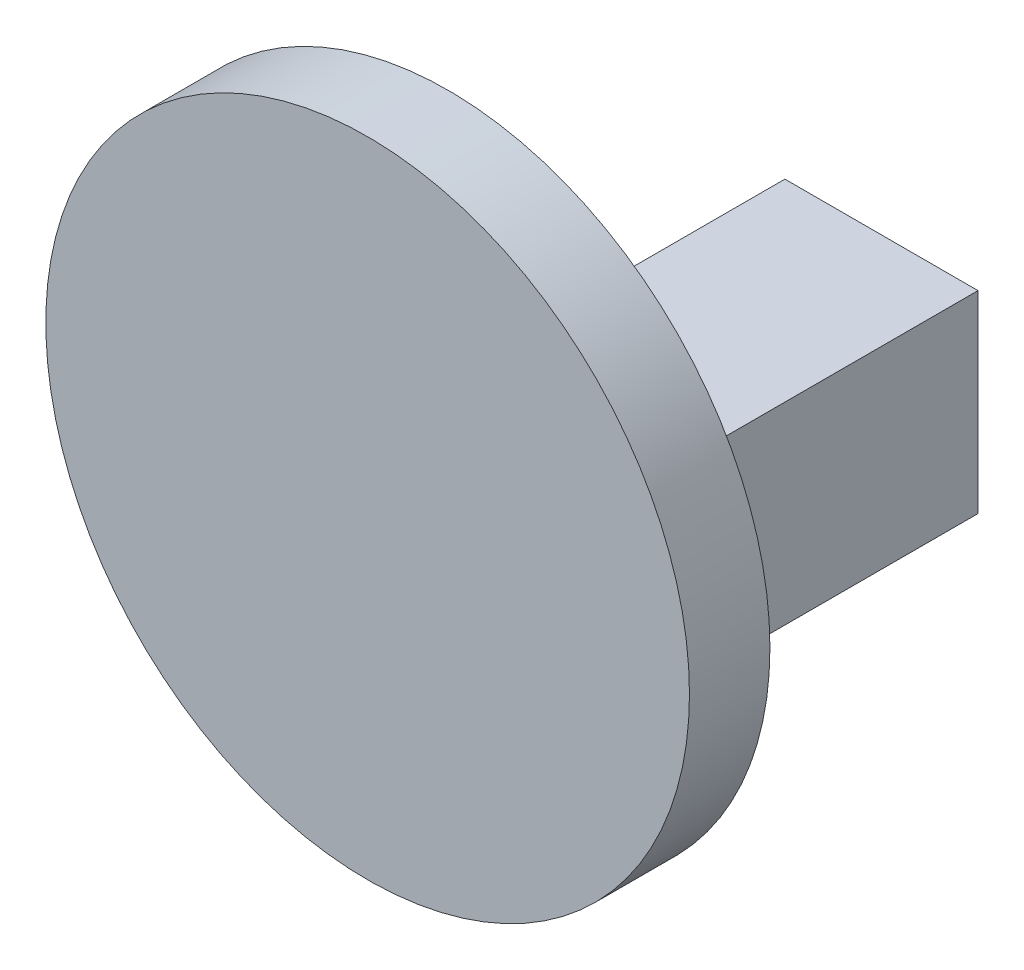
ISO-10303-21;
HEADER;
FILE_DESCRIPTION(('STEP AP214'),'2;1');
FILE_NAME('part.step','',(''),(''),'','','');
FILE_SCHEMA(('AUTOMOTIVE_DESIGN { 1 0 10303 214 1 1 1 1 }'));
ENDSEC;
DATA;
#1=APPLICATION_CONTEXT('core data for automotive mechanical design processes');
#2=APPLICATION_PROTOCOL_DEFINITION('international standard','automotive_design',2000,#1);
#3=PRODUCT_CONTEXT('',#1,'mechanical');
#4=PRODUCT('Part','Part','',(#3));
#5=PRODUCT_RELATED_PRODUCT_CATEGORY('part','',(#4));
#6=PRODUCT_DEFINITION_FORMATION('','',#4);
#7=PRODUCT_DEFINITION_CONTEXT('part definition',#1,'design');
#8=PRODUCT_DEFINITION('design','',#6,#7);
#9=PRODUCT_DEFINITION_SHAPE('','',#8);
#10=(LENGTH_UNIT() NAMED_UNIT(*) SI_UNIT(.MILLI.,.METRE.));
#11=(NAMED_UNIT(*) PLANE_ANGLE_UNIT() SI_UNIT($,.RADIAN.));
#12=(NAMED_UNIT(*) SI_UNIT($,.STERADIAN.) SOLID_ANGLE_UNIT());
#13=UNCERTAINTY_MEASURE_WITH_UNIT(LENGTH_MEASURE(1.E-05),#10,'distance_accuracy_value','');
#14=(GEOMETRIC_REPRESENTATION_CONTEXT(3) GLOBAL_UNCERTAINTY_ASSIGNED_CONTEXT((#13)) GLOBAL_UNIT_ASSIGNED_CONTEXT((#10,
#11,#12)) REPRESENTATION_CONTEXT('',''));
#15=CARTESIAN_POINT('',(0.,0.,0.));
#16=DIRECTION('',(0.,0.,1.));
#17=DIRECTION('',(1.,0.,0.));
#18=AXIS2_PLACEMENT_3D('',#15,#16,#17);
#19=CARTESIAN_POINT('',(73.8981732668994,12.5500000000009,275.981331654442));
#20=DIRECTION('',(0.,1.,0.));
#21=DIRECTION('',(-1.,0.,0.));
#22=AXIS2_PLACEMENT_3D('',#19,#20,#21);
#23=PLANE('',#22);
#24=DIRECTION('',(0.,0.,-1.));
#25=VECTOR('',#24,1.);
#26=CARTESIAN_POINT('',(61.8981732668994,12.5500000000009,252.302759373456));
#27=LINE('',#26,#25);
#28=CARTESIAN_POINT('',(61.8981732668994,12.5500000000009,275.481331654442));
#29=VERTEX_POINT('',#28);
#30=CARTESIAN_POINT('',(61.8981732668994,12.5500000000009,252.302759373456));
#31=VERTEX_POINT('',#30);
#32=EDGE_CURVE('E88',#29,#31,#27,.T.);
#33=ORIENTED_EDGE('',*,*,#32,.F.);
#34=DIRECTION('',(-1.,0.,0.));
#35=VECTOR('',#34,1.);
#36=CARTESIAN_POINT('',(73.8981732668994,12.5500000000009,275.481331654442));
#37=LINE('',#36,#35);
#38=CARTESIAN_POINT('',(73.8981732668994,12.5500000000009,275.481331654442));
#39=VERTEX_POINT('',#38);
#40=EDGE_CURVE('E11',#29,#39,#37,.F.);
#41=ORIENTED_EDGE('',*,*,#40,.T.);
#42=DIRECTION('',(0.,0.,-1.));
#43=VECTOR('',#42,1.);
#44=CARTESIAN_POINT('',(73.8981732668994,12.5500000000009,252.302759373456));
#45=LINE('',#44,#43);
#46=CARTESIAN_POINT('',(73.8981732668994,12.5500000000009,252.302759373456));
#47=VERTEX_POINT('',#46);
#48=EDGE_CURVE('E100',#39,#47,#45,.T.);
#49=ORIENTED_EDGE('',*,*,#48,.T.);
#50=DIRECTION('',(-1.,0.,0.));
#51=VECTOR('',#50,1.);
#52=CARTESIAN_POINT('',(73.8981732668994,12.5500000000009,252.302759373456));
#53=LINE('',#52,#51);
#54=EDGE_CURVE('E98',#47,#31,#53,.T.);
#55=ORIENTED_EDGE('',*,*,#54,.T.);
#56=EDGE_LOOP('',(#33,#41,#49,#55));
#57=FACE_BOUND('',#56,.T.);
#58=ADVANCED_FACE('F35',(#57),#23,.T.);
#59=CARTESIAN_POINT('',(73.8981732668994,0.55000000000085,254.516262844905));
#60=DIRECTION('',(0.,-1.,0.));
#61=DIRECTION('',(1.,0.,0.));
#62=AXIS2_PLACEMENT_3D('',#59,#60,#61);
#63=PLANE('',#62);
#64=DIRECTION('',(0.,0.,1.));
#65=VECTOR('',#64,1.);
#66=CARTESIAN_POINT('',(73.8981732668994,0.55000000000085,254.516262844905));
#67=LINE('',#66,#65);
#68=CARTESIAN_POINT('',(73.8981732668994,0.55000000000085,252.302759373456));
#69=VERTEX_POINT('',#68);
#70=CARTESIAN_POINT('',(73.8981732668994,0.55000000000085,275.481331654442));
#71=VERTEX_POINT('',#70);
#72=EDGE_CURVE('E105',#69,#71,#67,.T.);
#73=ORIENTED_EDGE('',*,*,#72,.T.);
#74=DIRECTION('',(-1.,0.,0.));
#75=VECTOR('',#74,1.);
#76=CARTESIAN_POINT('',(73.8981732668994,0.55000000000085,275.481331654442));
#77=LINE('',#76,#75);
#78=CARTESIAN_POINT('',(61.8981732668994,0.550000000000851,275.481331654442));
#79=VERTEX_POINT('',#78);
#80=EDGE_CURVE('E59',#71,#79,#77,.T.);
#81=ORIENTED_EDGE('',*,*,#80,.T.);
#82=DIRECTION('',(0.,0.,1.));
#83=VECTOR('',#82,1.);
#84=CARTESIAN_POINT('',(61.8981732668994,0.550000000000851,254.516262844905));
#85=LINE('',#84,#83);
#86=CARTESIAN_POINT('',(61.8981732668994,0.550000000000851,252.302759373456));
#87=VERTEX_POINT('',#86);
#88=EDGE_CURVE('E108',#87,#79,#85,.T.);
#89=ORIENTED_EDGE('',*,*,#88,.F.);
#90=DIRECTION('',(-1.,0.,0.));
#91=VECTOR('',#90,1.);
#92=CARTESIAN_POINT('',(73.8981732668994,0.55000000000085,252.302759373456));
#93=LINE('',#92,#91);
#94=EDGE_CURVE('E104',#69,#87,#93,.T.);
#95=ORIENTED_EDGE('',*,*,#94,.F.);
#96=EDGE_LOOP('',(#73,#81,#89,#95));
#97=FACE_BOUND('',#96,.T.);
#98=ADVANCED_FACE('F169',(#97),#63,.T.);
#99=CARTESIAN_POINT('',(73.8981732668994,0.55000000000085,252.302759373456));
#100=DIRECTION('',(0.,0.,-1.));
#101=DIRECTION('',(-1.,0.,0.));
#102=AXIS2_PLACEMENT_3D('',#99,#100,#101);
#103=PLANE('',#102);
#104=CARTESIAN_POINT('',(67.969208633093,7.01344682078051,252.302759373456));
#105=DIRECTION('',(0.,0.,-1.));
#106=DIRECTION('',(-1.,0.,0.));
#107=AXIS2_PLACEMENT_3D('',#104,#105,#106);
#108=CIRCLE('',#107,3.75000000000001);
#109=CARTESIAN_POINT('',(64.219208633093,7.01344682078051,252.302759373456));
#110=VERTEX_POINT('',#109);
#111=EDGE_CURVE('E152',#110,#110,#108,.T.);
#112=ORIENTED_EDGE('',*,*,#111,.F.);
#113=EDGE_LOOP('',(#112));
#114=FACE_BOUND('',#113,.T.);
#115=ORIENTED_EDGE('',*,*,#94,.T.);
#116=DIRECTION('',(0.,-1.,0.));
#117=VECTOR('',#116,1.);
#118=CARTESIAN_POINT('',(61.8981732668994,0.550000000000851,252.302759373456));
#119=LINE('',#118,#117);
#120=EDGE_CURVE('E92',#31,#87,#119,.T.);
#121=ORIENTED_EDGE('',*,*,#120,.F.);
#122=ORIENTED_EDGE('',*,*,#54,.F.);
#123=DIRECTION('',(0.,-1.,0.));
#124=VECTOR('',#123,1.);
#125=CARTESIAN_POINT('',(73.8981732668994,0.55000000000085,252.302759373456));
#126=LINE('',#125,#124);
#127=EDGE_CURVE('E114',#47,#69,#126,.T.);
#128=ORIENTED_EDGE('',*,*,#127,.T.);
#129=EDGE_LOOP('',(#115,#121,#122,#128));
#130=FACE_BOUND('',#129,.T.);
#131=ADVANCED_FACE('F107',(#114,#130),#103,.T.);
#132=CARTESIAN_POINT('',(73.8981732668994,0.,0.));
#133=DIRECTION('',(1.,0.,0.));
#134=DIRECTION('',(0.,0.,-1.));
#135=AXIS2_PLACEMENT_3D('',#132,#133,#134);
#136=PLANE('',#135);
#137=ORIENTED_EDGE('',*,*,#48,.F.);
#138=DIRECTION('',(0.,1.,0.));
#139=VECTOR('',#138,1.);
#140=CARTESIAN_POINT('',(73.8981732668994,0.,275.481331654442));
#141=LINE('',#140,#139);
#142=EDGE_CURVE('E127',#39,#71,#141,.F.);
#143=ORIENTED_EDGE('',*,*,#142,.T.);
#144=ORIENTED_EDGE('',*,*,#72,.F.);
#145=ORIENTED_EDGE('',*,*,#127,.F.);
#146=EDGE_LOOP('',(#137,#143,#144,#145));
#147=FACE_BOUND('',#146,.T.);
#148=ADVANCED_FACE('F168',(#147),#136,.T.);
#149=CARTESIAN_POINT('',(61.8981732668994,0.,0.));
#150=DIRECTION('',(1.,0.,0.));
#151=DIRECTION('',(0.,0.,-1.));
#152=AXIS2_PLACEMENT_3D('',#149,#150,#151);
#153=PLANE('',#152);
#154=ORIENTED_EDGE('',*,*,#88,.T.);
#155=DIRECTION('',(0.,1.,0.));
#156=VECTOR('',#155,1.);
#157=CARTESIAN_POINT('',(61.8981732668994,12.5500000000009,275.481331654442));
#158=LINE('',#157,#156);
#159=EDGE_CURVE('E44',#79,#29,#158,.T.);
#160=ORIENTED_EDGE('',*,*,#159,.T.);
#161=ORIENTED_EDGE('',*,*,#32,.T.);
#162=ORIENTED_EDGE('',*,*,#120,.T.);
#163=EDGE_LOOP('',(#154,#160,#161,#162));
#164=FACE_BOUND('',#163,.T.);
#165=ADVANCED_FACE('F90',(#164),#153,.F.);
#166=CARTESIAN_POINT('',(64.6470960692796,10.5500000000009,275.981331654442));
#167=DIRECTION('',(0.,0.,1.));
#168=DIRECTION('',(1.,0.,0.));
#169=AXIS2_PLACEMENT_3D('',#166,#167,#168);
#170=PLANE('',#169);
#171=DIRECTION('',(-1.,0.,0.));
#172=VECTOR('',#171,1.);
#173=CARTESIAN_POINT('',(64.6470960692796,0.0500000000008514,275.981331654442));
#174=LINE('',#173,#172);
#175=CARTESIAN_POINT('',(61.3981732668994,0.0500000000008515,275.981331654442));
#176=VERTEX_POINT('',#175);
#177=CARTESIAN_POINT('',(74.3981732668994,0.0500000000008501,275.981331654442));
#178=VERTEX_POINT('',#177);
#179=EDGE_CURVE('E122',#176,#178,#174,.F.);
#180=ORIENTED_EDGE('',*,*,#179,.T.);
#181=DIRECTION('',(0.,1.,0.));
#182=VECTOR('',#181,1.);
#183=CARTESIAN_POINT('',(74.3981732668994,10.5500000000009,275.981331654442));
#184=LINE('',#183,#182);
#185=CARTESIAN_POINT('',(74.3981732668994,13.0500000000009,275.981331654442));
#186=VERTEX_POINT('',#185);
#187=EDGE_CURVE('E124',#178,#186,#184,.T.);
#188=ORIENTED_EDGE('',*,*,#187,.T.);
#189=DIRECTION('',(-1.,0.,0.));
#190=VECTOR('',#189,1.);
#191=CARTESIAN_POINT('',(64.6470960692796,13.0500000000009,275.981331654442));
#192=LINE('',#191,#190);
#193=CARTESIAN_POINT('',(61.3981732668994,13.0500000000009,275.981331654442));
#194=VERTEX_POINT('',#193);
#195=EDGE_CURVE('E117',#186,#194,#192,.T.);
#196=ORIENTED_EDGE('',*,*,#195,.T.);
#197=DIRECTION('',(0.,1.,0.));
#198=VECTOR('',#197,1.);
#199=CARTESIAN_POINT('',(61.3981732668994,0.550000000000851,275.981331654442));
#200=LINE('',#199,#198);
#201=EDGE_CURVE('E120',#194,#176,#200,.F.);
#202=ORIENTED_EDGE('',*,*,#201,.T.);
#203=EDGE_LOOP('',(#180,#188,#196,#202));
#204=FACE_BOUND('',#203,.T.);
#205=CARTESIAN_POINT('',(64.6470960692796,10.5500000000009,275.981331654442));
#206=DIRECTION('',(0.,0.,1.));
#207=DIRECTION('',(1.,0.,0.));
#208=AXIS2_PLACEMENT_3D('',#205,#206,#207);
#209=CIRCLE('',#208,20.);
#210=CARTESIAN_POINT('',(84.6470960692796,10.5500000000009,275.981331654442));
#211=VERTEX_POINT('',#210);
#212=EDGE_CURVE('E142',#211,#211,#209,.T.);
#213=ORIENTED_EDGE('',*,*,#212,.F.);
#214=EDGE_LOOP('',(#213));
#215=FACE_BOUND('',#214,.T.);
#216=ADVANCED_FACE('F186',(#204,#215),#170,.F.);
#217=CARTESIAN_POINT('',(64.6470960692796,10.5500000000009,280.981331654442));
#218=DIRECTION('',(0.,0.,-1.));
#219=DIRECTION('',(-1.,0.,0.));
#220=AXIS2_PLACEMENT_3D('',#217,#218,#219);
#221=CYLINDRICAL_SURFACE('',#220,20.);
#222=CARTESIAN_POINT('',(64.6470960692796,10.5500000000009,280.981331654442));
#223=DIRECTION('',(0.,0.,1.));
#224=DIRECTION('',(1.,0.,0.));
#225=AXIS2_PLACEMENT_3D('',#222,#223,#224);
#226=CIRCLE('',#225,20.);
#227=CARTESIAN_POINT('',(84.6470960692796,10.5500000000009,280.981331654442));
#228=VERTEX_POINT('',#227);
#229=EDGE_CURVE('E95',#228,#228,#226,.T.);
#230=ORIENTED_EDGE('',*,*,#229,.F.);
#231=EDGE_LOOP('',(#230));
#232=FACE_BOUND('',#231,.T.);
#233=ORIENTED_EDGE('',*,*,#212,.T.);
#234=EDGE_LOOP('',(#233));
#235=FACE_BOUND('',#234,.T.);
#236=ADVANCED_FACE('F187',(#232,#235),#221,.T.);
#237=CARTESIAN_POINT('',(64.6470960692796,10.5500000000009,280.981331654442));
#238=DIRECTION('',(0.,0.,1.));
#239=DIRECTION('',(1.,0.,0.));
#240=AXIS2_PLACEMENT_3D('',#237,#238,#239);
#241=PLANE('',#240);
#242=ORIENTED_EDGE('',*,*,#229,.T.);
#243=EDGE_LOOP('',(#242));
#244=FACE_BOUND('',#243,.T.);
#245=ADVANCED_FACE('F190',(#244),#241,.T.);
#246=CARTESIAN_POINT('',(61.3981732668994,0.,275.481331654442));
#247=DIRECTION('',(0.,-1.,0.));
#248=DIRECTION('',(0.,0.,-1.));
#249=AXIS2_PLACEMENT_3D('',#246,#247,#248);
#250=CYLINDRICAL_SURFACE('',#249,0.5);
#251=CARTESIAN_POINT('',(61.3981732668994,13.0500000000009,275.481331654442));
#252=DIRECTION('',(-0.707106781186548,-0.707106781186547,0.));
#253=DIRECTION('',(-0.707106781186547,0.707106781186547,0.));
#254=AXIS2_PLACEMENT_3D('',#251,#252,#253);
#255=ELLIPSE('',#254,0.707106781186548,0.5);
#256=EDGE_CURVE('E136',#29,#194,#255,.T.);
#257=ORIENTED_EDGE('',*,*,#256,.F.);
#258=ORIENTED_EDGE('',*,*,#159,.F.);
#259=CARTESIAN_POINT('',(61.3981732668994,0.0500000000008515,275.481331654442));
#260=DIRECTION('',(0.707106781186547,-0.707106781186547,0.));
#261=DIRECTION('',(-0.707106781186548,-0.707106781186547,0.));
#262=AXIS2_PLACEMENT_3D('',#259,#260,#261);
#263=ELLIPSE('',#262,0.707106781186547,0.5);
#264=EDGE_CURVE('E39',#176,#79,#263,.F.);
#265=ORIENTED_EDGE('',*,*,#264,.F.);
#266=ORIENTED_EDGE('',*,*,#201,.F.);
#267=EDGE_LOOP('',(#257,#258,#265,#266));
#268=FACE_BOUND('',#267,.T.);
#269=ADVANCED_FACE('F37',(#268),#250,.F.);
#270=CARTESIAN_POINT('',(73.8981732668994,0.0500000000008501,275.481331654442));
#271=DIRECTION('',(-1.,0.,0.));
#272=DIRECTION('',(0.,-1.,0.));
#273=AXIS2_PLACEMENT_3D('',#270,#271,#272);
#274=CYLINDRICAL_SURFACE('',#273,0.5);
#275=ORIENTED_EDGE('',*,*,#264,.T.);
#276=ORIENTED_EDGE('',*,*,#80,.F.);
#277=CARTESIAN_POINT('',(74.3981732668994,0.0500000000008499,275.481331654442));
#278=DIRECTION('',(-0.707106781186548,-0.707106781186547,0.));
#279=DIRECTION('',(-0.707106781186547,0.707106781186547,0.));
#280=AXIS2_PLACEMENT_3D('',#277,#278,#279);
#281=ELLIPSE('',#280,0.707106781186548,0.5);
#282=EDGE_CURVE('E134',#178,#71,#281,.T.);
#283=ORIENTED_EDGE('',*,*,#282,.F.);
#284=ORIENTED_EDGE('',*,*,#179,.F.);
#285=EDGE_LOOP('',(#275,#276,#283,#284));
#286=FACE_BOUND('',#285,.T.);
#287=ADVANCED_FACE('F218',(#286),#274,.F.);
#288=CARTESIAN_POINT('',(64.6470960692796,13.0500000000009,275.481331654442));
#289=DIRECTION('',(-1.,0.,0.));
#290=DIRECTION('',(0.,-1.,0.));
#291=AXIS2_PLACEMENT_3D('',#288,#289,#290);
#292=CYLINDRICAL_SURFACE('',#291,0.5);
#293=ORIENTED_EDGE('',*,*,#256,.T.);
#294=ORIENTED_EDGE('',*,*,#195,.F.);
#295=CARTESIAN_POINT('',(74.3981732668994,13.0500000000009,275.481331654442));
#296=DIRECTION('',(-0.707106781186547,0.707106781186547,0.));
#297=DIRECTION('',(-0.707106781186548,-0.707106781186547,0.));
#298=AXIS2_PLACEMENT_3D('',#295,#296,#297);
#299=ELLIPSE('',#298,0.707106781186547,0.5);
#300=EDGE_CURVE('E132',#39,#186,#299,.T.);
#301=ORIENTED_EDGE('',*,*,#300,.F.);
#302=ORIENTED_EDGE('',*,*,#40,.F.);
#303=EDGE_LOOP('',(#293,#294,#301,#302));
#304=FACE_BOUND('',#303,.T.);
#305=ADVANCED_FACE('F211',(#304),#292,.F.);
#306=CARTESIAN_POINT('',(74.3981732668994,10.5500000000009,275.481331654442));
#307=DIRECTION('',(0.,1.,0.));
#308=DIRECTION('',(0.,0.,1.));
#309=AXIS2_PLACEMENT_3D('',#306,#307,#308);
#310=CYLINDRICAL_SURFACE('',#309,0.5);
#311=ORIENTED_EDGE('',*,*,#282,.T.);
#312=ORIENTED_EDGE('',*,*,#142,.F.);
#313=ORIENTED_EDGE('',*,*,#300,.T.);
#314=ORIENTED_EDGE('',*,*,#187,.F.);
#315=EDGE_LOOP('',(#311,#312,#313,#314));
#316=FACE_BOUND('',#315,.T.);
#317=ADVANCED_FACE('F163',(#316),#310,.F.);
#318=CARTESIAN_POINT('',(67.969208633093,7.01344682078051,267.302759373456));
#319=DIRECTION('',(0.,0.,-1.));
#320=DIRECTION('',(-1.,0.,0.));
#321=AXIS2_PLACEMENT_3D('',#318,#319,#320);
#322=CYLINDRICAL_SURFACE('',#321,3.75000000000001);
#323=CARTESIAN_POINT('',(67.969208633093,7.01344682078051,267.302759373456));
#324=DIRECTION('',(0.,0.,-1.));
#325=DIRECTION('',(-1.,0.,0.));
#326=AXIS2_PLACEMENT_3D('',#323,#324,#325);
#327=CIRCLE('',#326,3.75000000000001);
#328=CARTESIAN_POINT('',(64.219208633093,7.01344682078051,267.302759373456));
#329=VERTEX_POINT('',#328);
#330=EDGE_CURVE('E135',#329,#329,#327,.T.);
#331=ORIENTED_EDGE('',*,*,#330,.F.);
#332=EDGE_LOOP('',(#331));
#333=FACE_BOUND('',#332,.T.);
#334=ORIENTED_EDGE('',*,*,#111,.T.);
#335=EDGE_LOOP('',(#334));
#336=FACE_BOUND('',#335,.T.);
#337=ADVANCED_FACE('F160',(#333,#336),#322,.F.);
#338=CARTESIAN_POINT('',(67.969208633093,7.01344682078051,267.302759373456));
#339=DIRECTION('',(0.,0.,-1.));
#340=DIRECTION('',(-1.,0.,0.));
#341=AXIS2_PLACEMENT_3D('',#338,#339,#340);
#342=PLANE('',#341);
#343=ORIENTED_EDGE('',*,*,#330,.T.);
#344=EDGE_LOOP('',(#343));
#345=FACE_BOUND('',#344,.T.);
#346=ADVANCED_FACE('F158',(#345),#342,.T.);
#347=CLOSED_SHELL('',(#58,#98,#131,#148,#165,#216,#236,#245,#269,#287,#305,#317,#337,#346));
#348=MANIFOLD_SOLID_BREP('B2',#347);
#349=ADVANCED_BREP_SHAPE_REPRESENTATION('',(#18,#348),#14);
#350=SHAPE_DEFINITION_REPRESENTATION(#9,#349);
ENDSEC;
END-ISO-10303-21;
